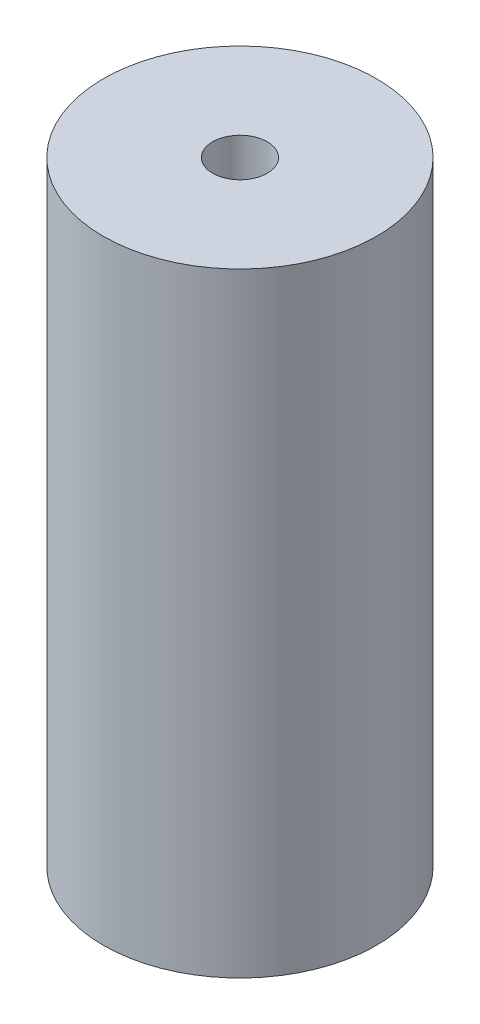
ISO-10303-21;
HEADER;
FILE_DESCRIPTION(('STEP AP214'),'2;1');
FILE_NAME('part.step','',(''),(''),'','','');
FILE_SCHEMA(('AUTOMOTIVE_DESIGN { 1 0 10303 214 1 1 1 1 }'));
ENDSEC;
DATA;
#1=APPLICATION_CONTEXT('core data for automotive mechanical design processes');
#2=APPLICATION_PROTOCOL_DEFINITION('international standard','automotive_design',2000,#1);
#3=PRODUCT_CONTEXT('',#1,'mechanical');
#4=PRODUCT('Part','Part','',(#3));
#5=PRODUCT_RELATED_PRODUCT_CATEGORY('part','',(#4));
#6=PRODUCT_DEFINITION_FORMATION('','',#4);
#7=PRODUCT_DEFINITION_CONTEXT('part definition',#1,'design');
#8=PRODUCT_DEFINITION('design','',#6,#7);
#9=PRODUCT_DEFINITION_SHAPE('','',#8);
#10=(LENGTH_UNIT() NAMED_UNIT(*) SI_UNIT(.MILLI.,.METRE.));
#11=(NAMED_UNIT(*) PLANE_ANGLE_UNIT() SI_UNIT($,.RADIAN.));
#12=(NAMED_UNIT(*) SI_UNIT($,.STERADIAN.) SOLID_ANGLE_UNIT());
#13=UNCERTAINTY_MEASURE_WITH_UNIT(LENGTH_MEASURE(1.E-05),#10,'distance_accuracy_value','');
#14=(GEOMETRIC_REPRESENTATION_CONTEXT(3) GLOBAL_UNCERTAINTY_ASSIGNED_CONTEXT((#13)) GLOBAL_UNIT_ASSIGNED_CONTEXT((#10,
#11,#12)) REPRESENTATION_CONTEXT('',''));
#15=CARTESIAN_POINT('',(0.,0.,0.));
#16=DIRECTION('',(0.,0.,1.));
#17=DIRECTION('',(1.,0.,0.));
#18=AXIS2_PLACEMENT_3D('',#15,#16,#17);
#19=CARTESIAN_POINT('',(0.,17.8435,0.));
#20=DIRECTION('',(0.,1.,0.));
#21=DIRECTION('',(0.,0.,1.));
#22=AXIS2_PLACEMENT_3D('',#19,#20,#21);
#23=PLANE('',#22);
#24=CARTESIAN_POINT('',(0.,17.8435,0.));
#25=DIRECTION('',(0.,1.,0.));
#26=DIRECTION('',(0.,0.,1.));
#27=AXIS2_PLACEMENT_3D('',#24,#25,#26);
#28=CIRCLE('',#27,7.9375);
#29=CARTESIAN_POINT('',(0.,17.8435,7.9375));
#30=VERTEX_POINT('',#29);
#31=EDGE_CURVE('E12',#30,#30,#28,.T.);
#32=ORIENTED_EDGE('',*,*,#31,.T.);
#33=EDGE_LOOP('',(#32));
#34=FACE_BOUND('',#33,.T.);
#35=CARTESIAN_POINT('',(0.,17.8435,0.));
#36=DIRECTION('',(0.,1.,0.));
#37=DIRECTION('',(0.,0.,1.));
#38=AXIS2_PLACEMENT_3D('',#35,#36,#37);
#39=CIRCLE('',#38,1.5875);
#40=CARTESIAN_POINT('',(0.,17.8435,1.5875));
#41=VERTEX_POINT('',#40);
#42=EDGE_CURVE('E54',#41,#41,#39,.T.);
#43=ORIENTED_EDGE('',*,*,#42,.F.);
#44=EDGE_LOOP('',(#43));
#45=FACE_BOUND('',#44,.T.);
#46=ADVANCED_FACE('F43',(#34,#45),#23,.T.);
#47=CARTESIAN_POINT('',(0.,-17.8435,0.));
#48=DIRECTION('',(0.,1.,0.));
#49=DIRECTION('',(0.,0.,1.));
#50=AXIS2_PLACEMENT_3D('',#47,#48,#49);
#51=PLANE('',#50);
#52=CARTESIAN_POINT('',(0.,-17.8435,0.));
#53=DIRECTION('',(0.,1.,0.));
#54=DIRECTION('',(0.,0.,1.));
#55=AXIS2_PLACEMENT_3D('',#52,#53,#54);
#56=CIRCLE('',#55,7.9375);
#57=CARTESIAN_POINT('',(0.,-17.8435,7.9375));
#58=VERTEX_POINT('',#57);
#59=EDGE_CURVE('E47',#58,#58,#56,.T.);
#60=ORIENTED_EDGE('',*,*,#59,.F.);
#61=EDGE_LOOP('',(#60));
#62=FACE_BOUND('',#61,.T.);
#63=CARTESIAN_POINT('',(0.,-17.8435,0.));
#64=DIRECTION('',(0.,1.,0.));
#65=DIRECTION('',(0.,0.,1.));
#66=AXIS2_PLACEMENT_3D('',#63,#64,#65);
#67=CIRCLE('',#66,1.5875);
#68=CARTESIAN_POINT('',(0.,-17.8435,1.5875));
#69=VERTEX_POINT('',#68);
#70=EDGE_CURVE('E56',#69,#69,#67,.T.);
#71=ORIENTED_EDGE('',*,*,#70,.T.);
#72=EDGE_LOOP('',(#71));
#73=FACE_BOUND('',#72,.T.);
#74=ADVANCED_FACE('F66',(#62,#73),#51,.F.);
#75=CARTESIAN_POINT('',(0.,17.8435,0.));
#76=DIRECTION('',(0.,-1.,0.));
#77=DIRECTION('',(0.,0.,-1.));
#78=AXIS2_PLACEMENT_3D('',#75,#76,#77);
#79=CYLINDRICAL_SURFACE('',#78,7.9375);
#80=ORIENTED_EDGE('',*,*,#31,.F.);
#81=EDGE_LOOP('',(#80));
#82=FACE_BOUND('',#81,.T.);
#83=ORIENTED_EDGE('',*,*,#59,.T.);
#84=EDGE_LOOP('',(#83));
#85=FACE_BOUND('',#84,.T.);
#86=ADVANCED_FACE('F45',(#82,#85),#79,.T.);
#87=CARTESIAN_POINT('',(0.,17.8435,0.));
#88=DIRECTION('',(0.,-1.,0.));
#89=DIRECTION('',(0.,0.,-1.));
#90=AXIS2_PLACEMENT_3D('',#87,#88,#89);
#91=CYLINDRICAL_SURFACE('',#90,1.5875);
#92=ORIENTED_EDGE('',*,*,#42,.T.);
#93=EDGE_LOOP('',(#92));
#94=FACE_BOUND('',#93,.T.);
#95=ORIENTED_EDGE('',*,*,#70,.F.);
#96=EDGE_LOOP('',(#95));
#97=FACE_BOUND('',#96,.T.);
#98=ADVANCED_FACE('F62',(#94,#97),#91,.F.);
#99=CLOSED_SHELL('',(#46,#74,#86,#98));
#100=MANIFOLD_SOLID_BREP('B2',#99);
#101=ADVANCED_BREP_SHAPE_REPRESENTATION('',(#18,#100),#14);
#102=SHAPE_DEFINITION_REPRESENTATION(#9,#101);
ENDSEC;
END-ISO-10303-21;
